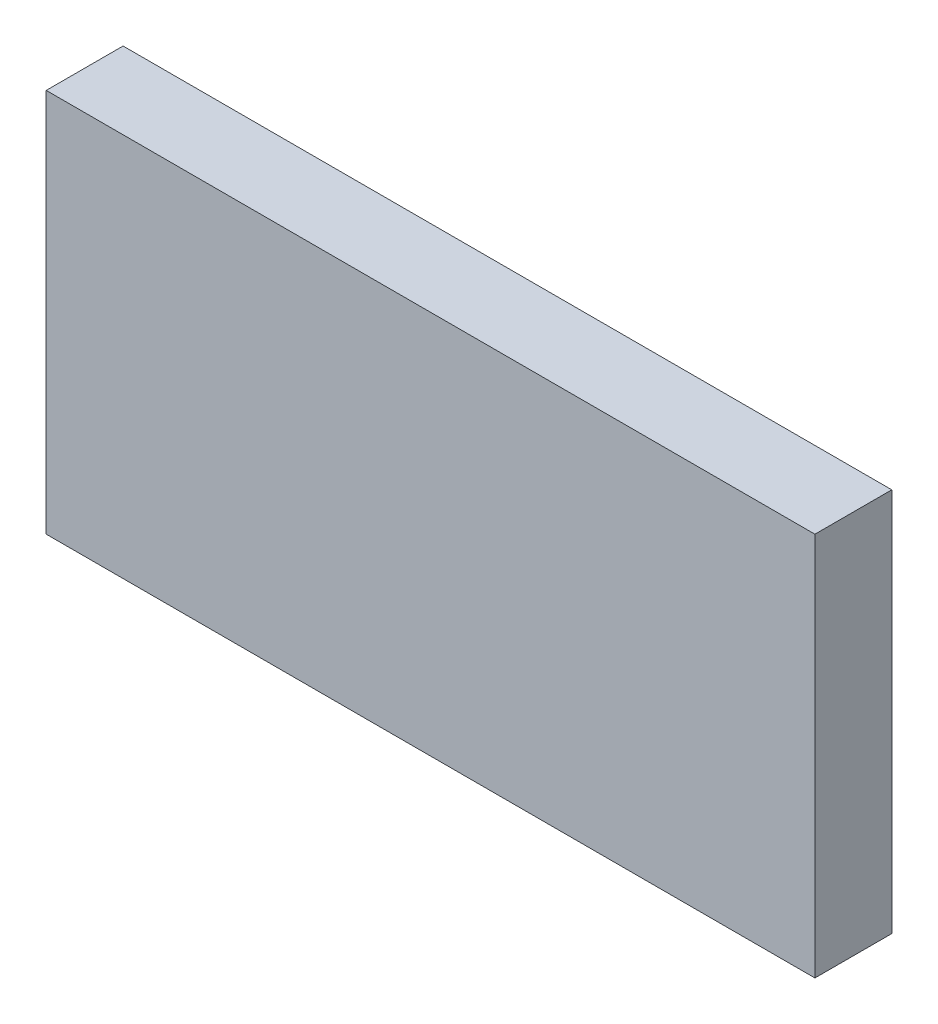
ISO-10303-21;
HEADER;
FILE_DESCRIPTION(('STEP AP214'),'2;1');
FILE_NAME('part.step','',(''),(''),'','','');
FILE_SCHEMA(('AUTOMOTIVE_DESIGN { 1 0 10303 214 1 1 1 1 }'));
ENDSEC;
DATA;
#1=APPLICATION_CONTEXT('core data for automotive mechanical design processes');
#2=APPLICATION_PROTOCOL_DEFINITION('international standard','automotive_design',2000,#1);
#3=PRODUCT_CONTEXT('',#1,'mechanical');
#4=PRODUCT('Part','Part','',(#3));
#5=PRODUCT_RELATED_PRODUCT_CATEGORY('part','',(#4));
#6=PRODUCT_DEFINITION_FORMATION('','',#4);
#7=PRODUCT_DEFINITION_CONTEXT('part definition',#1,'design');
#8=PRODUCT_DEFINITION('design','',#6,#7);
#9=PRODUCT_DEFINITION_SHAPE('','',#8);
#10=(LENGTH_UNIT() NAMED_UNIT(*) SI_UNIT(.MILLI.,.METRE.));
#11=(NAMED_UNIT(*) PLANE_ANGLE_UNIT() SI_UNIT($,.RADIAN.));
#12=(NAMED_UNIT(*) SI_UNIT($,.STERADIAN.) SOLID_ANGLE_UNIT());
#13=UNCERTAINTY_MEASURE_WITH_UNIT(LENGTH_MEASURE(1.E-05),#10,'distance_accuracy_value','');
#14=(GEOMETRIC_REPRESENTATION_CONTEXT(3) GLOBAL_UNCERTAINTY_ASSIGNED_CONTEXT((#13)) GLOBAL_UNIT_ASSIGNED_CONTEXT((#10,
#11,#12)) REPRESENTATION_CONTEXT('',''));
#15=CARTESIAN_POINT('',(0.,0.,0.));
#16=DIRECTION('',(0.,0.,1.));
#17=DIRECTION('',(1.,0.,0.));
#18=AXIS2_PLACEMENT_3D('',#15,#16,#17);
#19=CARTESIAN_POINT('',(15.,-7.5,3.));
#20=DIRECTION('',(-1.,0.,0.));
#21=DIRECTION('',(0.,0.,1.));
#22=AXIS2_PLACEMENT_3D('',#19,#20,#21);
#23=PLANE('',#22);
#24=DIRECTION('',(0.,1.,0.));
#25=VECTOR('',#24,1.);
#26=CARTESIAN_POINT('',(15.,-7.5,0.));
#27=LINE('',#26,#25);
#28=CARTESIAN_POINT('',(15.,-7.5,0.));
#29=VERTEX_POINT('',#28);
#30=CARTESIAN_POINT('',(15.,7.5,0.));
#31=VERTEX_POINT('',#30);
#32=EDGE_CURVE('E101',#29,#31,#27,.T.);
#33=ORIENTED_EDGE('',*,*,#32,.T.);
#34=DIRECTION('',(0.,0.,-1.));
#35=VECTOR('',#34,1.);
#36=CARTESIAN_POINT('',(15.,7.5,3.));
#37=LINE('',#36,#35);
#38=CARTESIAN_POINT('',(15.,7.5,3.));
#39=VERTEX_POINT('',#38);
#40=EDGE_CURVE('E11',#39,#31,#37,.T.);
#41=ORIENTED_EDGE('',*,*,#40,.F.);
#42=DIRECTION('',(0.,1.,0.));
#43=VECTOR('',#42,1.);
#44=CARTESIAN_POINT('',(15.,-7.5,3.));
#45=LINE('',#44,#43);
#46=CARTESIAN_POINT('',(15.,-7.5,3.));
#47=VERTEX_POINT('',#46);
#48=EDGE_CURVE('E89',#47,#39,#45,.T.);
#49=ORIENTED_EDGE('',*,*,#48,.F.);
#50=DIRECTION('',(0.,0.,-1.));
#51=VECTOR('',#50,1.);
#52=CARTESIAN_POINT('',(15.,-7.5,3.));
#53=LINE('',#52,#51);
#54=EDGE_CURVE('E97',#47,#29,#53,.T.);
#55=ORIENTED_EDGE('',*,*,#54,.T.);
#56=EDGE_LOOP('',(#33,#41,#49,#55));
#57=FACE_BOUND('',#56,.T.);
#58=ADVANCED_FACE('F38',(#57),#23,.F.);
#59=CARTESIAN_POINT('',(-15.,7.5,3.));
#60=DIRECTION('',(0.,-1.,0.));
#61=DIRECTION('',(0.,0.,-1.));
#62=AXIS2_PLACEMENT_3D('',#59,#60,#61);
#63=PLANE('',#62);
#64=DIRECTION('',(-1.,0.,0.));
#65=VECTOR('',#64,1.);
#66=CARTESIAN_POINT('',(-15.,7.5,0.));
#67=LINE('',#66,#65);
#68=CARTESIAN_POINT('',(-15.,7.5,0.));
#69=VERTEX_POINT('',#68);
#70=EDGE_CURVE('E93',#31,#69,#67,.T.);
#71=ORIENTED_EDGE('',*,*,#70,.T.);
#72=DIRECTION('',(0.,0.,-1.));
#73=VECTOR('',#72,1.);
#74=CARTESIAN_POINT('',(-15.,7.5,3.));
#75=LINE('',#74,#73);
#76=CARTESIAN_POINT('',(-15.,7.5,3.));
#77=VERTEX_POINT('',#76);
#78=EDGE_CURVE('E46',#77,#69,#75,.T.);
#79=ORIENTED_EDGE('',*,*,#78,.F.);
#80=DIRECTION('',(-1.,0.,0.));
#81=VECTOR('',#80,1.);
#82=CARTESIAN_POINT('',(-15.,7.5,3.));
#83=LINE('',#82,#81);
#84=EDGE_CURVE('E84',#39,#77,#83,.T.);
#85=ORIENTED_EDGE('',*,*,#84,.F.);
#86=ORIENTED_EDGE('',*,*,#40,.T.);
#87=EDGE_LOOP('',(#71,#79,#85,#86));
#88=FACE_BOUND('',#87,.T.);
#89=ADVANCED_FACE('F92',(#88),#63,.F.);
#90=CARTESIAN_POINT('',(-15.,-7.5,3.));
#91=DIRECTION('',(1.,0.,0.));
#92=DIRECTION('',(0.,0.,-1.));
#93=AXIS2_PLACEMENT_3D('',#90,#91,#92);
#94=PLANE('',#93);
#95=DIRECTION('',(0.,-1.,0.));
#96=VECTOR('',#95,1.);
#97=CARTESIAN_POINT('',(-15.,-7.5,0.));
#98=LINE('',#97,#96);
#99=CARTESIAN_POINT('',(-15.,-7.5,0.));
#100=VERTEX_POINT('',#99);
#101=EDGE_CURVE('E71',#69,#100,#98,.T.);
#102=ORIENTED_EDGE('',*,*,#101,.T.);
#103=DIRECTION('',(0.,0.,-1.));
#104=VECTOR('',#103,1.);
#105=CARTESIAN_POINT('',(-15.,-7.5,3.));
#106=LINE('',#105,#104);
#107=CARTESIAN_POINT('',(-15.,-7.5,3.));
#108=VERTEX_POINT('',#107);
#109=EDGE_CURVE('E94',#108,#100,#106,.T.);
#110=ORIENTED_EDGE('',*,*,#109,.F.);
#111=DIRECTION('',(0.,-1.,0.));
#112=VECTOR('',#111,1.);
#113=CARTESIAN_POINT('',(-15.,-7.5,3.));
#114=LINE('',#113,#112);
#115=EDGE_CURVE('E87',#77,#108,#114,.T.);
#116=ORIENTED_EDGE('',*,*,#115,.F.);
#117=ORIENTED_EDGE('',*,*,#78,.T.);
#118=EDGE_LOOP('',(#102,#110,#116,#117));
#119=FACE_BOUND('',#118,.T.);
#120=ADVANCED_FACE('F95',(#119),#94,.F.);
#121=CARTESIAN_POINT('',(-15.,-7.5,3.));
#122=DIRECTION('',(0.,1.,0.));
#123=DIRECTION('',(0.,0.,1.));
#124=AXIS2_PLACEMENT_3D('',#121,#122,#123);
#125=PLANE('',#124);
#126=DIRECTION('',(1.,0.,0.));
#127=VECTOR('',#126,1.);
#128=CARTESIAN_POINT('',(-15.,-7.5,0.));
#129=LINE('',#128,#127);
#130=EDGE_CURVE('E77',#100,#29,#129,.T.);
#131=ORIENTED_EDGE('',*,*,#130,.T.);
#132=ORIENTED_EDGE('',*,*,#54,.F.);
#133=DIRECTION('',(1.,0.,0.));
#134=VECTOR('',#133,1.);
#135=CARTESIAN_POINT('',(-15.,-7.5,3.));
#136=LINE('',#135,#134);
#137=EDGE_CURVE('E54',#108,#47,#136,.T.);
#138=ORIENTED_EDGE('',*,*,#137,.F.);
#139=ORIENTED_EDGE('',*,*,#109,.T.);
#140=EDGE_LOOP('',(#131,#132,#138,#139));
#141=FACE_BOUND('',#140,.T.);
#142=ADVANCED_FACE('F108',(#141),#125,.F.);
#143=CARTESIAN_POINT('',(0.,0.,3.));
#144=DIRECTION('',(0.,0.,-1.));
#145=DIRECTION('',(-1.,0.,0.));
#146=AXIS2_PLACEMENT_3D('',#143,#144,#145);
#147=PLANE('',#146);
#148=ORIENTED_EDGE('',*,*,#48,.T.);
#149=ORIENTED_EDGE('',*,*,#84,.T.);
#150=ORIENTED_EDGE('',*,*,#115,.T.);
#151=ORIENTED_EDGE('',*,*,#137,.T.);
#152=EDGE_LOOP('',(#148,#149,#150,#151));
#153=FACE_BOUND('',#152,.T.);
#154=ADVANCED_FACE('F85',(#153),#147,.F.);
#155=CARTESIAN_POINT('',(0.,0.,0.));
#156=DIRECTION('',(0.,0.,-1.));
#157=DIRECTION('',(-1.,0.,0.));
#158=AXIS2_PLACEMENT_3D('',#155,#156,#157);
#159=PLANE('',#158);
#160=ORIENTED_EDGE('',*,*,#32,.F.);
#161=ORIENTED_EDGE('',*,*,#130,.F.);
#162=ORIENTED_EDGE('',*,*,#101,.F.);
#163=ORIENTED_EDGE('',*,*,#70,.F.);
#164=EDGE_LOOP('',(#160,#161,#162,#163));
#165=FACE_BOUND('',#164,.T.);
#166=ADVANCED_FACE('F111',(#165),#159,.T.);
#167=CLOSED_SHELL('',(#58,#89,#120,#142,#154,#166));
#168=MANIFOLD_SOLID_BREP('B2',#167);
#169=ADVANCED_BREP_SHAPE_REPRESENTATION('',(#18,#168),#14);
#170=SHAPE_DEFINITION_REPRESENTATION(#9,#169);
ENDSEC;
END-ISO-10303-21;
